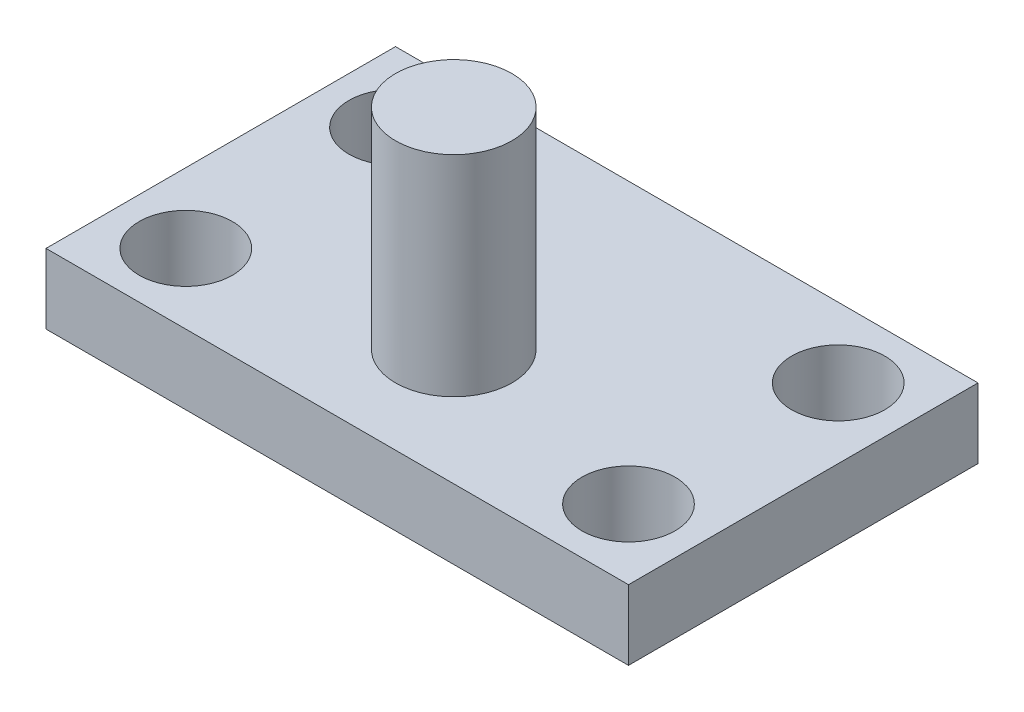
ISO-10303-21;
HEADER;
FILE_DESCRIPTION(('STEP AP214'),'2;1');
FILE_NAME('part.step','',(''),(''),'','','');
FILE_SCHEMA(('AUTOMOTIVE_DESIGN { 1 0 10303 214 1 1 1 1 }'));
ENDSEC;
DATA;
#1=APPLICATION_CONTEXT('core data for automotive mechanical design processes');
#2=APPLICATION_PROTOCOL_DEFINITION('international standard','automotive_design',2000,#1);
#3=PRODUCT_CONTEXT('',#1,'mechanical');
#4=PRODUCT('Part','Part','',(#3));
#5=PRODUCT_RELATED_PRODUCT_CATEGORY('part','',(#4));
#6=PRODUCT_DEFINITION_FORMATION('','',#4);
#7=PRODUCT_DEFINITION_CONTEXT('part definition',#1,'design');
#8=PRODUCT_DEFINITION('design','',#6,#7);
#9=PRODUCT_DEFINITION_SHAPE('','',#8);
#10=(LENGTH_UNIT() NAMED_UNIT(*) SI_UNIT(.MILLI.,.METRE.));
#11=(NAMED_UNIT(*) PLANE_ANGLE_UNIT() SI_UNIT($,.RADIAN.));
#12=(NAMED_UNIT(*) SI_UNIT($,.STERADIAN.) SOLID_ANGLE_UNIT());
#13=UNCERTAINTY_MEASURE_WITH_UNIT(LENGTH_MEASURE(1.E-05),#10,'distance_accuracy_value','');
#14=(GEOMETRIC_REPRESENTATION_CONTEXT(3) GLOBAL_UNCERTAINTY_ASSIGNED_CONTEXT((#13)) GLOBAL_UNIT_ASSIGNED_CONTEXT((#10,
#11,#12)) REPRESENTATION_CONTEXT('',''));
#15=CARTESIAN_POINT('',(0.,0.,0.));
#16=DIRECTION('',(0.,0.,1.));
#17=DIRECTION('',(1.,0.,0.));
#18=AXIS2_PLACEMENT_3D('',#15,#16,#17);
#19=CARTESIAN_POINT('',(0.,15.,0.));
#20=DIRECTION('',(0.,-1.,0.));
#21=DIRECTION('',(0.,0.,-1.));
#22=AXIS2_PLACEMENT_3D('',#19,#20,#21);
#23=PLANE('',#22);
#24=DIRECTION('',(0.,0.,-1.));
#25=VECTOR('',#24,1.);
#26=CARTESIAN_POINT('',(163.481860275543,15.,91.4535132677945));
#27=LINE('',#26,#25);
#28=CARTESIAN_POINT('',(163.481860275543,15.,91.4535132677945));
#29=VERTEX_POINT('',#28);
#30=CARTESIAN_POINT('',(163.481860275543,15.,-58.5464867322055));
#31=VERTEX_POINT('',#30);
#32=EDGE_CURVE('E85',#29,#31,#27,.T.);
#33=ORIENTED_EDGE('',*,*,#32,.T.);
#34=DIRECTION('',(-1.,0.,0.));
#35=VECTOR('',#34,1.);
#36=CARTESIAN_POINT('',(-86.5181397244565,15.,-58.5464867322055));
#37=LINE('',#36,#35);
#38=CARTESIAN_POINT('',(-86.5181397244565,15.,-58.5464867322055));
#39=VERTEX_POINT('',#38);
#40=EDGE_CURVE('E80',#31,#39,#37,.T.);
#41=ORIENTED_EDGE('',*,*,#40,.T.);
#42=DIRECTION('',(0.,0.,1.));
#43=VECTOR('',#42,1.);
#44=CARTESIAN_POINT('',(-86.5181397244565,15.,91.4535132677945));
#45=LINE('',#44,#43);
#46=CARTESIAN_POINT('',(-86.5181397244565,15.,91.4535132677945));
#47=VERTEX_POINT('',#46);
#48=EDGE_CURVE('E83',#39,#47,#45,.T.);
#49=ORIENTED_EDGE('',*,*,#48,.T.);
#50=DIRECTION('',(1.,0.,0.));
#51=VECTOR('',#50,1.);
#52=CARTESIAN_POINT('',(-86.5181397244565,15.,91.4535132677945));
#53=LINE('',#52,#51);
#54=EDGE_CURVE('E50',#47,#29,#53,.T.);
#55=ORIENTED_EDGE('',*,*,#54,.T.);
#56=EDGE_LOOP('',(#33,#41,#49,#55));
#57=FACE_BOUND('',#56,.T.);
#58=CARTESIAN_POINT('',(-56.5181397244558,15.,-28.5464867322055));
#59=DIRECTION('',(0.,1.,0.));
#60=DIRECTION('',(0.,0.,1.));
#61=AXIS2_PLACEMENT_3D('',#58,#59,#60);
#62=CIRCLE('',#61,20.);
#63=CARTESIAN_POINT('',(-56.5181397244558,15.,-8.5464867322055));
#64=VERTEX_POINT('',#63);
#65=EDGE_CURVE('E100',#64,#64,#62,.T.);
#66=ORIENTED_EDGE('',*,*,#65,.F.);
#67=EDGE_LOOP('',(#66));
#68=FACE_BOUND('',#67,.T.);
#69=CARTESIAN_POINT('',(38.4818602755435,15.,41.4535132677945));
#70=DIRECTION('',(0.,1.,0.));
#71=DIRECTION('',(0.,0.,1.));
#72=AXIS2_PLACEMENT_3D('',#69,#70,#71);
#73=CIRCLE('',#72,25.);
#74=CARTESIAN_POINT('',(38.4818602755435,15.,66.4535132677945));
#75=VERTEX_POINT('',#74);
#76=EDGE_CURVE('E115',#75,#75,#73,.T.);
#77=ORIENTED_EDGE('',*,*,#76,.F.);
#78=EDGE_LOOP('',(#77));
#79=FACE_BOUND('',#78,.T.);
#80=CARTESIAN_POINT('',(133.481860275544,15.,-28.5464867322055));
#81=DIRECTION('',(0.,1.,0.));
#82=DIRECTION('',(0.,0.,1.));
#83=AXIS2_PLACEMENT_3D('',#80,#81,#82);
#84=CIRCLE('',#83,20.);
#85=CARTESIAN_POINT('',(133.481860275544,15.,-8.54648673220553));
#86=VERTEX_POINT('',#85);
#87=EDGE_CURVE('E120',#86,#86,#84,.T.);
#88=ORIENTED_EDGE('',*,*,#87,.F.);
#89=EDGE_LOOP('',(#88));
#90=FACE_BOUND('',#89,.T.);
#91=CARTESIAN_POINT('',(133.481860275545,15.,61.4535132677945));
#92=DIRECTION('',(0.,1.,0.));
#93=DIRECTION('',(0.,0.,1.));
#94=AXIS2_PLACEMENT_3D('',#91,#92,#93);
#95=CIRCLE('',#94,20.);
#96=CARTESIAN_POINT('',(133.481860275545,15.,81.4535132677945));
#97=VERTEX_POINT('',#96);
#98=EDGE_CURVE('E124',#97,#97,#95,.T.);
#99=ORIENTED_EDGE('',*,*,#98,.F.);
#100=EDGE_LOOP('',(#99));
#101=FACE_BOUND('',#100,.T.);
#102=CARTESIAN_POINT('',(-56.5181397244549,15.,61.4535132677945));
#103=DIRECTION('',(0.,1.,0.));
#104=DIRECTION('',(0.,0.,1.));
#105=AXIS2_PLACEMENT_3D('',#102,#103,#104);
#106=CIRCLE('',#105,20.);
#107=CARTESIAN_POINT('',(-56.5181397244549,15.,81.4535132677945));
#108=VERTEX_POINT('',#107);
#109=EDGE_CURVE('E130',#108,#108,#106,.T.);
#110=ORIENTED_EDGE('',*,*,#109,.F.);
#111=EDGE_LOOP('',(#110));
#112=FACE_BOUND('',#111,.T.);
#113=ADVANCED_FACE('F33',(#57,#68,#79,#90,#101,#112),#23,.F.);
#114=CARTESIAN_POINT('',(0.,-15.,0.));
#115=DIRECTION('',(0.,-1.,0.));
#116=DIRECTION('',(0.,0.,-1.));
#117=AXIS2_PLACEMENT_3D('',#114,#115,#116);
#118=PLANE('',#117);
#119=CARTESIAN_POINT('',(133.481860275545,-15.,61.4535132677945));
#120=DIRECTION('',(0.,1.,0.));
#121=DIRECTION('',(0.,0.,1.));
#122=AXIS2_PLACEMENT_3D('',#119,#120,#121);
#123=CIRCLE('',#122,20.);
#124=CARTESIAN_POINT('',(133.481860275545,-15.,81.4535132677945));
#125=VERTEX_POINT('',#124);
#126=EDGE_CURVE('E127',#125,#125,#123,.T.);
#127=ORIENTED_EDGE('',*,*,#126,.T.);
#128=EDGE_LOOP('',(#127));
#129=FACE_BOUND('',#128,.T.);
#130=DIRECTION('',(0.,0.,-1.));
#131=VECTOR('',#130,1.);
#132=CARTESIAN_POINT('',(163.481860275543,-15.,91.4535132677945));
#133=LINE('',#132,#131);
#134=CARTESIAN_POINT('',(163.481860275543,-15.,91.4535132677945));
#135=VERTEX_POINT('',#134);
#136=CARTESIAN_POINT('',(163.481860275543,-15.,-58.5464867322055));
#137=VERTEX_POINT('',#136);
#138=EDGE_CURVE('E97',#135,#137,#133,.T.);
#139=ORIENTED_EDGE('',*,*,#138,.F.);
#140=DIRECTION('',(1.,0.,0.));
#141=VECTOR('',#140,1.);
#142=CARTESIAN_POINT('',(-86.5181397244565,-15.,91.4535132677945));
#143=LINE('',#142,#141);
#144=CARTESIAN_POINT('',(-86.5181397244565,-15.,91.4535132677945));
#145=VERTEX_POINT('',#144);
#146=EDGE_CURVE('E73',#145,#135,#143,.T.);
#147=ORIENTED_EDGE('',*,*,#146,.F.);
#148=DIRECTION('',(0.,0.,1.));
#149=VECTOR('',#148,1.);
#150=CARTESIAN_POINT('',(-86.5181397244565,-15.,91.4535132677945));
#151=LINE('',#150,#149);
#152=CARTESIAN_POINT('',(-86.5181397244565,-15.,-58.5464867322055));
#153=VERTEX_POINT('',#152);
#154=EDGE_CURVE('E67',#153,#145,#151,.T.);
#155=ORIENTED_EDGE('',*,*,#154,.F.);
#156=DIRECTION('',(-1.,0.,0.));
#157=VECTOR('',#156,1.);
#158=CARTESIAN_POINT('',(-86.5181397244565,-15.,-58.5464867322055));
#159=LINE('',#158,#157);
#160=EDGE_CURVE('E89',#137,#153,#159,.T.);
#161=ORIENTED_EDGE('',*,*,#160,.F.);
#162=EDGE_LOOP('',(#139,#147,#155,#161));
#163=FACE_BOUND('',#162,.T.);
#164=CARTESIAN_POINT('',(-56.5181397244558,-15.,-28.5464867322055));
#165=DIRECTION('',(0.,1.,0.));
#166=DIRECTION('',(0.,0.,1.));
#167=AXIS2_PLACEMENT_3D('',#164,#165,#166);
#168=CIRCLE('',#167,20.);
#169=CARTESIAN_POINT('',(-56.5181397244558,-15.,-8.5464867322055));
#170=VERTEX_POINT('',#169);
#171=EDGE_CURVE('E112',#170,#170,#168,.T.);
#172=ORIENTED_EDGE('',*,*,#171,.T.);
#173=EDGE_LOOP('',(#172));
#174=FACE_BOUND('',#173,.T.);
#175=CARTESIAN_POINT('',(133.481860275544,-15.,-28.5464867322055));
#176=DIRECTION('',(0.,1.,0.));
#177=DIRECTION('',(0.,0.,1.));
#178=AXIS2_PLACEMENT_3D('',#175,#176,#177);
#179=CIRCLE('',#178,20.);
#180=CARTESIAN_POINT('',(133.481860275544,-15.,-8.54648673220553));
#181=VERTEX_POINT('',#180);
#182=EDGE_CURVE('E121',#181,#181,#179,.T.);
#183=ORIENTED_EDGE('',*,*,#182,.T.);
#184=EDGE_LOOP('',(#183));
#185=FACE_BOUND('',#184,.T.);
#186=CARTESIAN_POINT('',(-56.5181397244549,-15.,61.4535132677945));
#187=DIRECTION('',(0.,1.,0.));
#188=DIRECTION('',(0.,0.,1.));
#189=AXIS2_PLACEMENT_3D('',#186,#187,#188);
#190=CIRCLE('',#189,20.);
#191=CARTESIAN_POINT('',(-56.5181397244549,-15.,81.4535132677945));
#192=VERTEX_POINT('',#191);
#193=EDGE_CURVE('E133',#192,#192,#190,.T.);
#194=ORIENTED_EDGE('',*,*,#193,.T.);
#195=EDGE_LOOP('',(#194));
#196=FACE_BOUND('',#195,.T.);
#197=ADVANCED_FACE('F108',(#129,#163,#174,#185,#196),#118,.T.);
#198=CARTESIAN_POINT('',(163.481860275543,15.,91.4535132677945));
#199=DIRECTION('',(-1.,0.,0.));
#200=DIRECTION('',(0.,0.,1.));
#201=AXIS2_PLACEMENT_3D('',#198,#199,#200);
#202=PLANE('',#201);
#203=ORIENTED_EDGE('',*,*,#138,.T.);
#204=DIRECTION('',(0.,-1.,0.));
#205=VECTOR('',#204,1.);
#206=CARTESIAN_POINT('',(163.481860275543,15.,-58.5464867322055));
#207=LINE('',#206,#205);
#208=EDGE_CURVE('E11',#31,#137,#207,.T.);
#209=ORIENTED_EDGE('',*,*,#208,.F.);
#210=ORIENTED_EDGE('',*,*,#32,.F.);
#211=DIRECTION('',(0.,-1.,0.));
#212=VECTOR('',#211,1.);
#213=CARTESIAN_POINT('',(163.481860275543,15.,91.4535132677945));
#214=LINE('',#213,#212);
#215=EDGE_CURVE('E93',#29,#135,#214,.T.);
#216=ORIENTED_EDGE('',*,*,#215,.T.);
#217=EDGE_LOOP('',(#203,#209,#210,#216));
#218=FACE_BOUND('',#217,.T.);
#219=ADVANCED_FACE('F35',(#218),#202,.F.);
#220=CARTESIAN_POINT('',(-86.5181397244565,15.,-58.5464867322055));
#221=DIRECTION('',(0.,0.,1.));
#222=DIRECTION('',(1.,0.,0.));
#223=AXIS2_PLACEMENT_3D('',#220,#221,#222);
#224=PLANE('',#223);
#225=ORIENTED_EDGE('',*,*,#160,.T.);
#226=DIRECTION('',(0.,-1.,0.));
#227=VECTOR('',#226,1.);
#228=CARTESIAN_POINT('',(-86.5181397244565,15.,-58.5464867322055));
#229=LINE('',#228,#227);
#230=EDGE_CURVE('E42',#39,#153,#229,.T.);
#231=ORIENTED_EDGE('',*,*,#230,.F.);
#232=ORIENTED_EDGE('',*,*,#40,.F.);
#233=ORIENTED_EDGE('',*,*,#208,.T.);
#234=EDGE_LOOP('',(#225,#231,#232,#233));
#235=FACE_BOUND('',#234,.T.);
#236=ADVANCED_FACE('F88',(#235),#224,.F.);
#237=CARTESIAN_POINT('',(-86.5181397244565,15.,91.4535132677945));
#238=DIRECTION('',(1.,0.,0.));
#239=DIRECTION('',(0.,0.,-1.));
#240=AXIS2_PLACEMENT_3D('',#237,#238,#239);
#241=PLANE('',#240);
#242=ORIENTED_EDGE('',*,*,#154,.T.);
#243=DIRECTION('',(0.,-1.,0.));
#244=VECTOR('',#243,1.);
#245=CARTESIAN_POINT('',(-86.5181397244565,15.,91.4535132677945));
#246=LINE('',#245,#244);
#247=EDGE_CURVE('E90',#47,#145,#246,.T.);
#248=ORIENTED_EDGE('',*,*,#247,.F.);
#249=ORIENTED_EDGE('',*,*,#48,.F.);
#250=ORIENTED_EDGE('',*,*,#230,.T.);
#251=EDGE_LOOP('',(#242,#248,#249,#250));
#252=FACE_BOUND('',#251,.T.);
#253=ADVANCED_FACE('F91',(#252),#241,.F.);
#254=CARTESIAN_POINT('',(-86.5181397244565,15.,91.4535132677945));
#255=DIRECTION('',(0.,0.,-1.));
#256=DIRECTION('',(-1.,0.,0.));
#257=AXIS2_PLACEMENT_3D('',#254,#255,#256);
#258=PLANE('',#257);
#259=ORIENTED_EDGE('',*,*,#146,.T.);
#260=ORIENTED_EDGE('',*,*,#215,.F.);
#261=ORIENTED_EDGE('',*,*,#54,.F.);
#262=ORIENTED_EDGE('',*,*,#247,.T.);
#263=EDGE_LOOP('',(#259,#260,#261,#262));
#264=FACE_BOUND('',#263,.T.);
#265=ADVANCED_FACE('F105',(#264),#258,.F.);
#266=CARTESIAN_POINT('',(-56.5181397244558,15.,-28.5464867322055));
#267=DIRECTION('',(0.,-1.,0.));
#268=DIRECTION('',(0.,0.,-1.));
#269=AXIS2_PLACEMENT_3D('',#266,#267,#268);
#270=CYLINDRICAL_SURFACE('',#269,20.);
#271=ORIENTED_EDGE('',*,*,#65,.T.);
#272=EDGE_LOOP('',(#271));
#273=FACE_BOUND('',#272,.T.);
#274=ORIENTED_EDGE('',*,*,#171,.F.);
#275=EDGE_LOOP('',(#274));
#276=FACE_BOUND('',#275,.T.);
#277=ADVANCED_FACE('F161',(#273,#276),#270,.F.);
#278=CARTESIAN_POINT('',(133.481860275544,15.,-28.5464867322055));
#279=DIRECTION('',(0.,-1.,0.));
#280=DIRECTION('',(0.,0.,-1.));
#281=AXIS2_PLACEMENT_3D('',#278,#279,#280);
#282=CYLINDRICAL_SURFACE('',#281,20.);
#283=ORIENTED_EDGE('',*,*,#87,.T.);
#284=EDGE_LOOP('',(#283));
#285=FACE_BOUND('',#284,.T.);
#286=ORIENTED_EDGE('',*,*,#182,.F.);
#287=EDGE_LOOP('',(#286));
#288=FACE_BOUND('',#287,.T.);
#289=ADVANCED_FACE('F207',(#285,#288),#282,.F.);
#290=CARTESIAN_POINT('',(133.481860275545,15.,61.4535132677945));
#291=DIRECTION('',(0.,-1.,0.));
#292=DIRECTION('',(0.,0.,-1.));
#293=AXIS2_PLACEMENT_3D('',#290,#291,#292);
#294=CYLINDRICAL_SURFACE('',#293,20.);
#295=ORIENTED_EDGE('',*,*,#98,.T.);
#296=EDGE_LOOP('',(#295));
#297=FACE_BOUND('',#296,.T.);
#298=ORIENTED_EDGE('',*,*,#126,.F.);
#299=EDGE_LOOP('',(#298));
#300=FACE_BOUND('',#299,.T.);
#301=ADVANCED_FACE('F197',(#297,#300),#294,.F.);
#302=CARTESIAN_POINT('',(-56.5181397244549,15.,61.4535132677945));
#303=DIRECTION('',(0.,-1.,0.));
#304=DIRECTION('',(0.,0.,-1.));
#305=AXIS2_PLACEMENT_3D('',#302,#303,#304);
#306=CYLINDRICAL_SURFACE('',#305,20.);
#307=ORIENTED_EDGE('',*,*,#109,.T.);
#308=EDGE_LOOP('',(#307));
#309=FACE_BOUND('',#308,.T.);
#310=ORIENTED_EDGE('',*,*,#193,.F.);
#311=EDGE_LOOP('',(#310));
#312=FACE_BOUND('',#311,.T.);
#313=ADVANCED_FACE('F151',(#309,#312),#306,.F.);
#314=CARTESIAN_POINT('',(38.4818602755435,105.,41.4535132677945));
#315=DIRECTION('',(0.,-1.,0.));
#316=DIRECTION('',(0.,0.,-1.));
#317=AXIS2_PLACEMENT_3D('',#314,#315,#316);
#318=CYLINDRICAL_SURFACE('',#317,25.);
#319=CARTESIAN_POINT('',(38.4818602755435,105.,41.4535132677945));
#320=DIRECTION('',(0.,-1.,0.));
#321=DIRECTION('',(0.,0.,-1.));
#322=AXIS2_PLACEMENT_3D('',#319,#320,#321);
#323=CIRCLE('',#322,25.);
#324=CARTESIAN_POINT('',(38.4818602755435,105.,16.4535132677945));
#325=VERTEX_POINT('',#324);
#326=EDGE_CURVE('E136',#325,#325,#323,.T.);
#327=ORIENTED_EDGE('',*,*,#326,.T.);
#328=EDGE_LOOP('',(#327));
#329=FACE_BOUND('',#328,.T.);
#330=ORIENTED_EDGE('',*,*,#76,.T.);
#331=EDGE_LOOP('',(#330));
#332=FACE_BOUND('',#331,.T.);
#333=ADVANCED_FACE('F142',(#329,#332),#318,.T.);
#334=CARTESIAN_POINT('',(38.4818602755435,105.,41.4535132677945));
#335=DIRECTION('',(0.,-1.,0.));
#336=DIRECTION('',(0.,0.,-1.));
#337=AXIS2_PLACEMENT_3D('',#334,#335,#336);
#338=PLANE('',#337);
#339=ORIENTED_EDGE('',*,*,#326,.F.);
#340=EDGE_LOOP('',(#339));
#341=FACE_BOUND('',#340,.T.);
#342=ADVANCED_FACE('F145',(#341),#338,.F.);
#343=CLOSED_SHELL('',(#113,#197,#219,#236,#253,#265,#277,#289,#301,#313,#333,#342));
#344=MANIFOLD_SOLID_BREP('B2',#343);
#345=ADVANCED_BREP_SHAPE_REPRESENTATION('',(#18,#344),#14);
#346=SHAPE_DEFINITION_REPRESENTATION(#9,#345);
ENDSEC;
END-ISO-10303-21;
